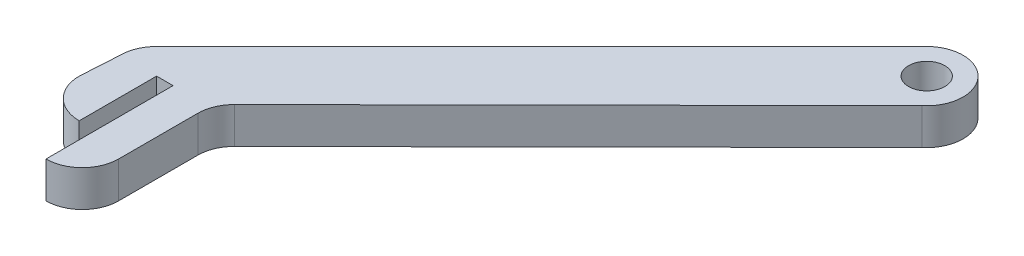
ISO-10303-21;
HEADER;
FILE_DESCRIPTION(('STEP AP214'),'2;1');
FILE_NAME('part.step','',(''),(''),'','','');
FILE_SCHEMA(('AUTOMOTIVE_DESIGN { 1 0 10303 214 1 1 1 1 }'));
ENDSEC;
DATA;
#1=APPLICATION_CONTEXT('core data for automotive mechanical design processes');
#2=APPLICATION_PROTOCOL_DEFINITION('international standard','automotive_design',2000,#1);
#3=PRODUCT_CONTEXT('',#1,'mechanical');
#4=PRODUCT('Part','Part','',(#3));
#5=PRODUCT_RELATED_PRODUCT_CATEGORY('part','',(#4));
#6=PRODUCT_DEFINITION_FORMATION('','',#4);
#7=PRODUCT_DEFINITION_CONTEXT('part definition',#1,'design');
#8=PRODUCT_DEFINITION('design','',#6,#7);
#9=PRODUCT_DEFINITION_SHAPE('','',#8);
#10=(LENGTH_UNIT() NAMED_UNIT(*) SI_UNIT(.MILLI.,.METRE.));
#11=(NAMED_UNIT(*) PLANE_ANGLE_UNIT() SI_UNIT($,.RADIAN.));
#12=(NAMED_UNIT(*) SI_UNIT($,.STERADIAN.) SOLID_ANGLE_UNIT());
#13=UNCERTAINTY_MEASURE_WITH_UNIT(LENGTH_MEASURE(1.E-05),#10,'distance_accuracy_value','');
#14=(GEOMETRIC_REPRESENTATION_CONTEXT(3) GLOBAL_UNCERTAINTY_ASSIGNED_CONTEXT((#13)) GLOBAL_UNIT_ASSIGNED_CONTEXT((#10,
#11,#12)) REPRESENTATION_CONTEXT('',''));
#15=CARTESIAN_POINT('',(0.,0.,0.));
#16=DIRECTION('',(0.,0.,1.));
#17=DIRECTION('',(1.,0.,0.));
#18=AXIS2_PLACEMENT_3D('',#15,#16,#17);
#19=CARTESIAN_POINT('',(-14.4847879877651,10.,-0.886993363347131));
#20=DIRECTION('',(-0.998130320604424,0.,-0.0611217071923654));
#21=DIRECTION('',(-0.0611217071923654,0.,0.998130320604424));
#22=AXIS2_PLACEMENT_3D('',#19,#20,#21);
#23=PLANE('',#22);
#24=DIRECTION('',(0.0611217071923654,0.,-0.998130320604424));
#25=VECTOR('',#24,1.);
#26=CARTESIAN_POINT('',(-14.4847879877651,0.,-0.886993363347131));
#27=LINE('',#26,#25);
#28=CARTESIAN_POINT('',(-15.1914108706071,0.,10.6523067805086));
#29=VERTEX_POINT('',#28);
#30=CARTESIAN_POINT('',(-14.5391040900985,0.,0.));
#31=VERTEX_POINT('',#30);
#32=EDGE_CURVE('E153',#29,#31,#27,.T.);
#33=ORIENTED_EDGE('',*,*,#32,.F.);
#34=DIRECTION('',(0.,-1.,0.));
#35=VECTOR('',#34,1.);
#36=CARTESIAN_POINT('',(-15.1914108706071,10.,10.6523067805086));
#37=LINE('',#36,#35);
#38=CARTESIAN_POINT('',(-15.1914108706071,10.,10.6523067805086));
#39=VERTEX_POINT('',#38);
#40=EDGE_CURVE('E11',#39,#29,#37,.T.);
#41=ORIENTED_EDGE('',*,*,#40,.F.);
#42=DIRECTION('',(0.0611217071923654,0.,-0.998130320604424));
#43=VECTOR('',#42,1.);
#44=CARTESIAN_POINT('',(-14.4847879877651,10.,-0.886993363347131));
#45=LINE('',#44,#43);
#46=CARTESIAN_POINT('',(-14.5391040900985,10.,0.));
#47=VERTEX_POINT('',#46);
#48=EDGE_CURVE('E184',#39,#47,#45,.T.);
#49=ORIENTED_EDGE('',*,*,#48,.T.);
#50=DIRECTION('',(0.,-1.,0.));
#51=VECTOR('',#50,1.);
#52=CARTESIAN_POINT('',(-14.5391040900985,10.,0.));
#53=LINE('',#52,#51);
#54=EDGE_CURVE('E97',#47,#31,#53,.T.);
#55=ORIENTED_EDGE('',*,*,#54,.T.);
#56=EDGE_LOOP('',(#33,#41,#49,#55));
#57=FACE_BOUND('',#56,.T.);
#58=ADVANCED_FACE('F35',(#57),#23,.T.);
#59=CARTESIAN_POINT('',(-4.53910409009851,10.,10.6523067805086));
#60=DIRECTION('',(0.,-1.,0.));
#61=DIRECTION('',(0.,0.,-1.));
#62=AXIS2_PLACEMENT_3D('',#59,#60,#61);
#63=CYLINDRICAL_SURFACE('',#62,10.6523067805086);
#64=CARTESIAN_POINT('',(-4.53910409009851,0.,10.6523067805086));
#65=DIRECTION('',(0.,1.,0.));
#66=DIRECTION('',(0.,0.,1.));
#67=AXIS2_PLACEMENT_3D('',#64,#65,#66);
#68=CIRCLE('',#67,10.6523067805086);
#69=CARTESIAN_POINT('',(-4.53910409009851,0.,21.3046135610172));
#70=VERTEX_POINT('',#69);
#71=EDGE_CURVE('E156',#29,#70,#68,.T.);
#72=ORIENTED_EDGE('',*,*,#71,.T.);
#73=DIRECTION('',(0.,-1.,0.));
#74=VECTOR('',#73,1.);
#75=CARTESIAN_POINT('',(-4.53910409009851,10.,21.3046135610172));
#76=LINE('',#75,#74);
#77=CARTESIAN_POINT('',(-4.53910409009851,10.,21.3046135610172));
#78=VERTEX_POINT('',#77);
#79=EDGE_CURVE('E43',#78,#70,#76,.T.);
#80=ORIENTED_EDGE('',*,*,#79,.F.);
#81=CARTESIAN_POINT('',(-4.53910409009851,10.,10.6523067805086));
#82=DIRECTION('',(0.,1.,0.));
#83=DIRECTION('',(0.,0.,1.));
#84=AXIS2_PLACEMENT_3D('',#81,#82,#83);
#85=CIRCLE('',#84,10.6523067805086);
#86=EDGE_CURVE('E222',#39,#78,#85,.T.);
#87=ORIENTED_EDGE('',*,*,#86,.F.);
#88=ORIENTED_EDGE('',*,*,#40,.T.);
#89=EDGE_LOOP('',(#72,#80,#87,#88));
#90=FACE_BOUND('',#89,.T.);
#91=ADVANCED_FACE('F210',(#90),#63,.T.);
#92=CARTESIAN_POINT('',(-4.53910409009851,10.,0.));
#93=DIRECTION('',(1.,0.,0.));
#94=DIRECTION('',(0.,0.,-1.));
#95=AXIS2_PLACEMENT_3D('',#92,#93,#94);
#96=PLANE('',#95);
#97=DIRECTION('',(0.,0.,1.));
#98=VECTOR('',#97,1.);
#99=CARTESIAN_POINT('',(-4.53910409009851,0.,0.));
#100=LINE('',#99,#98);
#101=CARTESIAN_POINT('',(-4.53910409009851,0.,0.));
#102=VERTEX_POINT('',#101);
#103=EDGE_CURVE('E160',#102,#70,#100,.T.);
#104=ORIENTED_EDGE('',*,*,#103,.F.);
#105=DIRECTION('',(0.,-1.,0.));
#106=VECTOR('',#105,1.);
#107=CARTESIAN_POINT('',(-4.53910409009851,10.,0.));
#108=LINE('',#107,#106);
#109=CARTESIAN_POINT('',(-4.53910409009851,10.,0.));
#110=VERTEX_POINT('',#109);
#111=EDGE_CURVE('E200',#110,#102,#108,.T.);
#112=ORIENTED_EDGE('',*,*,#111,.F.);
#113=DIRECTION('',(0.,0.,1.));
#114=VECTOR('',#113,1.);
#115=CARTESIAN_POINT('',(-4.53910409009851,10.,0.));
#116=LINE('',#115,#114);
#117=EDGE_CURVE('E207',#110,#78,#116,.T.);
#118=ORIENTED_EDGE('',*,*,#117,.T.);
#119=ORIENTED_EDGE('',*,*,#79,.T.);
#120=EDGE_LOOP('',(#104,#112,#118,#119));
#121=FACE_BOUND('',#120,.T.);
#122=ADVANCED_FACE('F205',(#121),#96,.T.);
#123=CARTESIAN_POINT('',(0.,10.,0.));
#124=DIRECTION('',(0.,0.,1.));
#125=DIRECTION('',(1.,0.,0.));
#126=AXIS2_PLACEMENT_3D('',#123,#124,#125);
#127=PLANE('',#126);
#128=DIRECTION('',(-1.,0.,0.));
#129=VECTOR('',#128,1.);
#130=CARTESIAN_POINT('',(0.,0.,0.));
#131=LINE('',#130,#129);
#132=CARTESIAN_POINT('',(0.,0.,0.));
#133=VERTEX_POINT('',#132);
#134=EDGE_CURVE('E163',#133,#102,#131,.T.);
#135=ORIENTED_EDGE('',*,*,#134,.F.);
#136=DIRECTION('',(0.,-1.,0.));
#137=VECTOR('',#136,1.);
#138=CARTESIAN_POINT('',(0.,10.,0.));
#139=LINE('',#138,#137);
#140=CARTESIAN_POINT('',(0.,10.,0.));
#141=VERTEX_POINT('',#140);
#142=EDGE_CURVE('E198',#141,#133,#139,.T.);
#143=ORIENTED_EDGE('',*,*,#142,.F.);
#144=DIRECTION('',(-1.,0.,0.));
#145=VECTOR('',#144,1.);
#146=CARTESIAN_POINT('',(0.,10.,0.));
#147=LINE('',#146,#145);
#148=EDGE_CURVE('E221',#141,#110,#147,.T.);
#149=ORIENTED_EDGE('',*,*,#148,.T.);
#150=ORIENTED_EDGE('',*,*,#111,.T.);
#151=EDGE_LOOP('',(#135,#143,#149,#150));
#152=FACE_BOUND('',#151,.T.);
#153=ADVANCED_FACE('F217',(#152),#127,.T.);
#154=CARTESIAN_POINT('',(0.,10.,0.));
#155=DIRECTION('',(1.,0.,0.));
#156=DIRECTION('',(0.,0.,-1.));
#157=AXIS2_PLACEMENT_3D('',#154,#155,#156);
#158=PLANE('',#157);
#159=DIRECTION('',(0.,0.,1.));
#160=VECTOR('',#159,1.);
#161=CARTESIAN_POINT('',(0.,0.,0.));
#162=LINE('',#161,#160);
#163=CARTESIAN_POINT('',(0.,0.,35.));
#164=VERTEX_POINT('',#163);
#165=EDGE_CURVE('E166',#133,#164,#162,.T.);
#166=ORIENTED_EDGE('',*,*,#165,.T.);
#167=DIRECTION('',(0.,-1.,0.));
#168=VECTOR('',#167,1.);
#169=CARTESIAN_POINT('',(0.,10.,35.));
#170=LINE('',#169,#168);
#171=CARTESIAN_POINT('',(0.,10.,35.));
#172=VERTEX_POINT('',#171);
#173=EDGE_CURVE('E195',#172,#164,#170,.T.);
#174=ORIENTED_EDGE('',*,*,#173,.F.);
#175=DIRECTION('',(0.,0.,1.));
#176=VECTOR('',#175,1.);
#177=CARTESIAN_POINT('',(0.,10.,0.));
#178=LINE('',#177,#176);
#179=EDGE_CURVE('E224',#141,#172,#178,.T.);
#180=ORIENTED_EDGE('',*,*,#179,.F.);
#181=ORIENTED_EDGE('',*,*,#142,.T.);
#182=EDGE_LOOP('',(#166,#174,#180,#181));
#183=FACE_BOUND('',#182,.T.);
#184=ADVANCED_FACE('F274',(#183),#158,.F.);
#185=CARTESIAN_POINT('',(0.,10.,25.));
#186=DIRECTION('',(0.,-1.,0.));
#187=DIRECTION('',(0.,0.,-1.));
#188=AXIS2_PLACEMENT_3D('',#185,#186,#187);
#189=CYLINDRICAL_SURFACE('',#188,10.);
#190=CARTESIAN_POINT('',(0.,0.,25.));
#191=DIRECTION('',(0.,1.,0.));
#192=DIRECTION('',(0.,0.,1.));
#193=AXIS2_PLACEMENT_3D('',#190,#191,#192);
#194=CIRCLE('',#193,10.);
#195=CARTESIAN_POINT('',(10.,0.,25.));
#196=VERTEX_POINT('',#195);
#197=EDGE_CURVE('E168',#164,#196,#194,.T.);
#198=ORIENTED_EDGE('',*,*,#197,.T.);
#199=DIRECTION('',(0.,-1.,0.));
#200=VECTOR('',#199,1.);
#201=CARTESIAN_POINT('',(10.,10.,25.));
#202=LINE('',#201,#200);
#203=CARTESIAN_POINT('',(10.,10.,25.));
#204=VERTEX_POINT('',#203);
#205=EDGE_CURVE('E192',#204,#196,#202,.T.);
#206=ORIENTED_EDGE('',*,*,#205,.F.);
#207=CARTESIAN_POINT('',(0.,10.,25.));
#208=DIRECTION('',(0.,1.,0.));
#209=DIRECTION('',(0.,0.,1.));
#210=AXIS2_PLACEMENT_3D('',#207,#208,#209);
#211=CIRCLE('',#210,10.);
#212=EDGE_CURVE('E230',#172,#204,#211,.T.);
#213=ORIENTED_EDGE('',*,*,#212,.F.);
#214=ORIENTED_EDGE('',*,*,#173,.T.);
#215=EDGE_LOOP('',(#198,#206,#213,#214));
#216=FACE_BOUND('',#215,.T.);
#217=ADVANCED_FACE('F277',(#216),#189,.T.);
#218=CARTESIAN_POINT('',(10.,10.,0.));
#219=DIRECTION('',(-1.,0.,0.));
#220=DIRECTION('',(0.,0.,1.));
#221=AXIS2_PLACEMENT_3D('',#218,#219,#220);
#222=PLANE('',#221);
#223=DIRECTION('',(0.,0.,-1.));
#224=VECTOR('',#223,1.);
#225=CARTESIAN_POINT('',(10.,0.,0.));
#226=LINE('',#225,#224);
#227=CARTESIAN_POINT('',(10.,0.,3.1735011818597));
#228=VERTEX_POINT('',#227);
#229=EDGE_CURVE('E170',#196,#228,#226,.T.);
#230=ORIENTED_EDGE('',*,*,#229,.T.);
#231=DIRECTION('',(0.,-1.,0.));
#232=VECTOR('',#231,1.);
#233=CARTESIAN_POINT('',(10.,10.,3.1735011818597));
#234=LINE('',#233,#232);
#235=CARTESIAN_POINT('',(10.,10.,3.1735011818597));
#236=VERTEX_POINT('',#235);
#237=EDGE_CURVE('E190',#236,#228,#234,.T.);
#238=ORIENTED_EDGE('',*,*,#237,.F.);
#239=DIRECTION('',(0.,0.,-1.));
#240=VECTOR('',#239,1.);
#241=CARTESIAN_POINT('',(10.,10.,0.));
#242=LINE('',#241,#240);
#243=EDGE_CURVE('E232',#204,#236,#242,.T.);
#244=ORIENTED_EDGE('',*,*,#243,.F.);
#245=ORIENTED_EDGE('',*,*,#205,.T.);
#246=EDGE_LOOP('',(#230,#238,#244,#245));
#247=FACE_BOUND('',#246,.T.);
#248=ADVANCED_FACE('F281',(#247),#222,.F.);
#249=CARTESIAN_POINT('',(20.,10.,3.17350118185971));
#250=DIRECTION('',(0.,-1.,0.));
#251=DIRECTION('',(0.,0.,-1.));
#252=AXIS2_PLACEMENT_3D('',#249,#250,#251);
#253=CYLINDRICAL_SURFACE('',#252,10.);
#254=CARTESIAN_POINT('',(20.,0.,3.17350118185971));
#255=DIRECTION('',(0.,1.,0.));
#256=DIRECTION('',(0.,0.,1.));
#257=AXIS2_PLACEMENT_3D('',#254,#255,#256);
#258=CIRCLE('',#257,10.);
#259=CARTESIAN_POINT('',(12.948101887037,0.,-3.91668450008043));
#260=VERTEX_POINT('',#259);
#261=EDGE_CURVE('E173',#260,#228,#258,.T.);
#262=ORIENTED_EDGE('',*,*,#261,.F.);
#263=DIRECTION('',(0.,-1.,0.));
#264=VECTOR('',#263,1.);
#265=CARTESIAN_POINT('',(12.948101887037,10.,-3.91668450008043));
#266=LINE('',#265,#264);
#267=CARTESIAN_POINT('',(12.948101887037,10.,-3.91668450008043));
#268=VERTEX_POINT('',#267);
#269=EDGE_CURVE('E188',#268,#260,#266,.T.);
#270=ORIENTED_EDGE('',*,*,#269,.F.);
#271=CARTESIAN_POINT('',(20.,10.,3.17350118185971));
#272=DIRECTION('',(0.,1.,0.));
#273=DIRECTION('',(0.,0.,1.));
#274=AXIS2_PLACEMENT_3D('',#271,#272,#273);
#275=CIRCLE('',#274,10.);
#276=EDGE_CURVE('E234',#268,#236,#275,.T.);
#277=ORIENTED_EDGE('',*,*,#276,.T.);
#278=ORIENTED_EDGE('',*,*,#237,.T.);
#279=EDGE_LOOP('',(#262,#270,#277,#278));
#280=FACE_BOUND('',#279,.T.);
#281=ADVANCED_FACE('F285',(#280),#253,.F.);
#282=CARTESIAN_POINT('',(4.48068261631017,10.,4.50501003028988));
#283=DIRECTION('',(0.705189811296299,0.,0.709018568194015));
#284=DIRECTION('',(0.709018568194015,0.,-0.705189811296299));
#285=AXIS2_PLACEMENT_3D('',#282,#283,#284);
#286=PLANE('',#285);
#287=DIRECTION('',(-0.709018568194015,0.,0.705189811296299));
#288=VECTOR('',#287,1.);
#289=CARTESIAN_POINT('',(4.48068261631017,0.,4.50501003028988));
#290=LINE('',#289,#288);
#291=CARTESIAN_POINT('',(107.92484737007,0.,-98.3805479716919));
#292=VERTEX_POINT('',#291);
#293=EDGE_CURVE('E176',#292,#260,#290,.T.);
#294=ORIENTED_EDGE('',*,*,#293,.F.);
#295=DIRECTION('',(0.,-1.,0.));
#296=VECTOR('',#295,1.);
#297=CARTESIAN_POINT('',(107.92484737007,10.,-98.3805479716919));
#298=LINE('',#297,#296);
#299=CARTESIAN_POINT('',(107.92484737007,10.,-98.3805479716919));
#300=VERTEX_POINT('',#299);
#301=EDGE_CURVE('E146',#300,#292,#298,.T.);
#302=ORIENTED_EDGE('',*,*,#301,.F.);
#303=DIRECTION('',(-0.709018568194015,0.,0.705189811296299));
#304=VECTOR('',#303,1.);
#305=CARTESIAN_POINT('',(4.48068261631017,10.,4.50501003028988));
#306=LINE('',#305,#304);
#307=EDGE_CURVE('E135',#300,#268,#306,.T.);
#308=ORIENTED_EDGE('',*,*,#307,.T.);
#309=ORIENTED_EDGE('',*,*,#269,.T.);
#310=EDGE_LOOP('',(#294,#302,#308,#309));
#311=FACE_BOUND('',#310,.T.);
#312=ADVANCED_FACE('F238',(#311),#286,.T.);
#313=CARTESIAN_POINT('',(101.526913087884,10.,-106.066017177982));
#314=DIRECTION('',(0.,-1.,0.));
#315=DIRECTION('',(0.,0.,-1.));
#316=AXIS2_PLACEMENT_3D('',#313,#314,#315);
#317=CYLINDRICAL_SURFACE('',#316,10.);
#318=CARTESIAN_POINT('',(101.526913087884,0.,-106.066017177982));
#319=DIRECTION('',(0.,1.,0.));
#320=DIRECTION('',(0.,0.,1.));
#321=AXIS2_PLACEMENT_3D('',#318,#319,#320);
#322=CIRCLE('',#321,10.);
#323=CARTESIAN_POINT('',(94.4558452760187,0.,-113.137084989847));
#324=VERTEX_POINT('',#323);
#325=EDGE_CURVE('E142',#292,#324,#322,.T.);
#326=ORIENTED_EDGE('',*,*,#325,.T.);
#327=DIRECTION('',(0.,-1.,0.));
#328=VECTOR('',#327,1.);
#329=CARTESIAN_POINT('',(94.4558452760187,10.,-113.137084989847));
#330=LINE('',#329,#328);
#331=CARTESIAN_POINT('',(94.4558452760187,10.,-113.137084989847));
#332=VERTEX_POINT('',#331);
#333=EDGE_CURVE('E139',#332,#324,#330,.T.);
#334=ORIENTED_EDGE('',*,*,#333,.F.);
#335=CARTESIAN_POINT('',(101.526913087884,10.,-106.066017177982));
#336=DIRECTION('',(0.,1.,0.));
#337=DIRECTION('',(0.,0.,1.));
#338=AXIS2_PLACEMENT_3D('',#335,#336,#337);
#339=CIRCLE('',#338,10.);
#340=EDGE_CURVE('E128',#300,#332,#339,.T.);
#341=ORIENTED_EDGE('',*,*,#340,.F.);
#342=ORIENTED_EDGE('',*,*,#301,.T.);
#343=EDGE_LOOP('',(#326,#334,#341,#342));
#344=FACE_BOUND('',#343,.T.);
#345=ADVANCED_FACE('F140',(#344),#317,.T.);
#346=CARTESIAN_POINT('',(-9.34061985691467,10.,-9.34061985691477));
#347=DIRECTION('',(-0.707106781186544,0.,-0.707106781186551));
#348=DIRECTION('',(-0.707106781186551,0.,0.707106781186544));
#349=AXIS2_PLACEMENT_3D('',#346,#347,#348);
#350=PLANE('',#349);
#351=DIRECTION('',(0.707106781186551,0.,-0.707106781186544));
#352=VECTOR('',#351,1.);
#353=CARTESIAN_POINT('',(-9.34061985691467,0.,-9.34061985691477));
#354=LINE('',#353,#352);
#355=CARTESIAN_POINT('',(-11.6101719019639,0.,-7.07106781186551));
#356=VERTEX_POINT('',#355);
#357=EDGE_CURVE('E180',#356,#324,#354,.T.);
#358=ORIENTED_EDGE('',*,*,#357,.F.);
#359=DIRECTION('',(0.,-1.,0.));
#360=VECTOR('',#359,1.);
#361=CARTESIAN_POINT('',(-11.6101719019639,10.,-7.07106781186551));
#362=LINE('',#361,#360);
#363=CARTESIAN_POINT('',(-11.6101719019639,10.,-7.07106781186551));
#364=VERTEX_POINT('',#363);
#365=EDGE_CURVE('E90',#364,#356,#362,.T.);
#366=ORIENTED_EDGE('',*,*,#365,.F.);
#367=DIRECTION('',(0.707106781186551,0.,-0.707106781186544));
#368=VECTOR('',#367,1.);
#369=CARTESIAN_POINT('',(-9.34061985691467,10.,-9.34061985691477));
#370=LINE('',#369,#368);
#371=EDGE_CURVE('E132',#364,#332,#370,.T.);
#372=ORIENTED_EDGE('',*,*,#371,.T.);
#373=ORIENTED_EDGE('',*,*,#333,.T.);
#374=EDGE_LOOP('',(#358,#366,#372,#373));
#375=FACE_BOUND('',#374,.T.);
#376=ADVANCED_FACE('F148',(#375),#350,.T.);
#377=CARTESIAN_POINT('',(-4.53910409009851,10.,0.));
#378=DIRECTION('',(0.,-1.,0.));
#379=DIRECTION('',(0.,0.,-1.));
#380=AXIS2_PLACEMENT_3D('',#377,#378,#379);
#381=CYLINDRICAL_SURFACE('',#380,10.);
#382=CARTESIAN_POINT('',(-4.53910409009851,0.,0.));
#383=DIRECTION('',(0.,1.,0.));
#384=DIRECTION('',(0.,0.,1.));
#385=AXIS2_PLACEMENT_3D('',#382,#383,#384);
#386=CIRCLE('',#385,10.);
#387=EDGE_CURVE('E182',#356,#31,#386,.T.);
#388=ORIENTED_EDGE('',*,*,#387,.T.);
#389=ORIENTED_EDGE('',*,*,#54,.F.);
#390=CARTESIAN_POINT('',(-4.53910409009851,10.,0.));
#391=DIRECTION('',(0.,1.,0.));
#392=DIRECTION('',(0.,0.,1.));
#393=AXIS2_PLACEMENT_3D('',#390,#391,#392);
#394=CIRCLE('',#393,10.);
#395=EDGE_CURVE('E51',#364,#47,#394,.T.);
#396=ORIENTED_EDGE('',*,*,#395,.F.);
#397=ORIENTED_EDGE('',*,*,#365,.T.);
#398=EDGE_LOOP('',(#388,#389,#396,#397));
#399=FACE_BOUND('',#398,.T.);
#400=ADVANCED_FACE('F240',(#399),#381,.T.);
#401=CARTESIAN_POINT('',(0.,10.,0.));
#402=DIRECTION('',(0.,1.,0.));
#403=DIRECTION('',(0.,0.,1.));
#404=AXIS2_PLACEMENT_3D('',#401,#402,#403);
#405=PLANE('',#404);
#406=CARTESIAN_POINT('',(101.526913087884,10.,-106.066017177982));
#407=DIRECTION('',(0.,1.,0.));
#408=DIRECTION('',(0.,0.,1.));
#409=AXIS2_PLACEMENT_3D('',#406,#407,#408);
#410=CIRCLE('',#409,5.00000000000001);
#411=CARTESIAN_POINT('',(101.526913087884,10.,-101.066017177982));
#412=VERTEX_POINT('',#411);
#413=EDGE_CURVE('E242',#412,#412,#410,.T.);
#414=ORIENTED_EDGE('',*,*,#413,.F.);
#415=EDGE_LOOP('',(#414));
#416=FACE_BOUND('',#415,.T.);
#417=ORIENTED_EDGE('',*,*,#48,.F.);
#418=ORIENTED_EDGE('',*,*,#86,.T.);
#419=ORIENTED_EDGE('',*,*,#117,.F.);
#420=ORIENTED_EDGE('',*,*,#148,.F.);
#421=ORIENTED_EDGE('',*,*,#179,.T.);
#422=ORIENTED_EDGE('',*,*,#212,.T.);
#423=ORIENTED_EDGE('',*,*,#243,.T.);
#424=ORIENTED_EDGE('',*,*,#276,.F.);
#425=ORIENTED_EDGE('',*,*,#307,.F.);
#426=ORIENTED_EDGE('',*,*,#340,.T.);
#427=ORIENTED_EDGE('',*,*,#371,.F.);
#428=ORIENTED_EDGE('',*,*,#395,.T.);
#429=EDGE_LOOP('',(#417,#418,#419,#420,#421,#422,#423,#424,#425,#426,#427,#428));
#430=FACE_BOUND('',#429,.T.);
#431=ADVANCED_FACE('F130',(#416,#430),#405,.T.);
#432=CARTESIAN_POINT('',(0.,0.,0.));
#433=DIRECTION('',(0.,1.,0.));
#434=DIRECTION('',(0.,0.,1.));
#435=AXIS2_PLACEMENT_3D('',#432,#433,#434);
#436=PLANE('',#435);
#437=CARTESIAN_POINT('',(101.526913087884,0.,-106.066017177982));
#438=DIRECTION('',(0.,1.,0.));
#439=DIRECTION('',(0.,0.,1.));
#440=AXIS2_PLACEMENT_3D('',#437,#438,#439);
#441=CIRCLE('',#440,5.00000000000001);
#442=CARTESIAN_POINT('',(101.526913087884,0.,-101.066017177982));
#443=VERTEX_POINT('',#442);
#444=EDGE_CURVE('E157',#443,#443,#441,.T.);
#445=ORIENTED_EDGE('',*,*,#444,.T.);
#446=EDGE_LOOP('',(#445));
#447=FACE_BOUND('',#446,.T.);
#448=ORIENTED_EDGE('',*,*,#32,.T.);
#449=ORIENTED_EDGE('',*,*,#387,.F.);
#450=ORIENTED_EDGE('',*,*,#357,.T.);
#451=ORIENTED_EDGE('',*,*,#325,.F.);
#452=ORIENTED_EDGE('',*,*,#293,.T.);
#453=ORIENTED_EDGE('',*,*,#261,.T.);
#454=ORIENTED_EDGE('',*,*,#229,.F.);
#455=ORIENTED_EDGE('',*,*,#197,.F.);
#456=ORIENTED_EDGE('',*,*,#165,.F.);
#457=ORIENTED_EDGE('',*,*,#134,.T.);
#458=ORIENTED_EDGE('',*,*,#103,.T.);
#459=ORIENTED_EDGE('',*,*,#71,.F.);
#460=EDGE_LOOP('',(#448,#449,#450,#451,#452,#453,#454,#455,#456,#457,#458,#459));
#461=FACE_BOUND('',#460,.T.);
#462=ADVANCED_FACE('F212',(#447,#461),#436,.F.);
#463=CARTESIAN_POINT('',(101.526913087884,0.,-106.066017177982));
#464=DIRECTION('',(0.,1.,0.));
#465=DIRECTION('',(0.,0.,1.));
#466=AXIS2_PLACEMENT_3D('',#463,#464,#465);
#467=CYLINDRICAL_SURFACE('',#466,5.00000000000001);
#468=ORIENTED_EDGE('',*,*,#444,.F.);
#469=EDGE_LOOP('',(#468));
#470=FACE_BOUND('',#469,.T.);
#471=ORIENTED_EDGE('',*,*,#413,.T.);
#472=EDGE_LOOP('',(#471));
#473=FACE_BOUND('',#472,.T.);
#474=ADVANCED_FACE('F249',(#470,#473),#467,.F.);
#475=CLOSED_SHELL('',(#58,#91,#122,#153,#184,#217,#248,#281,#312,#345,#376,#400,#431,#462,#474));
#476=MANIFOLD_SOLID_BREP('B2',#475);
#477=ADVANCED_BREP_SHAPE_REPRESENTATION('',(#18,#476),#14);
#478=SHAPE_DEFINITION_REPRESENTATION(#9,#477);
ENDSEC;
END-ISO-10303-21;
